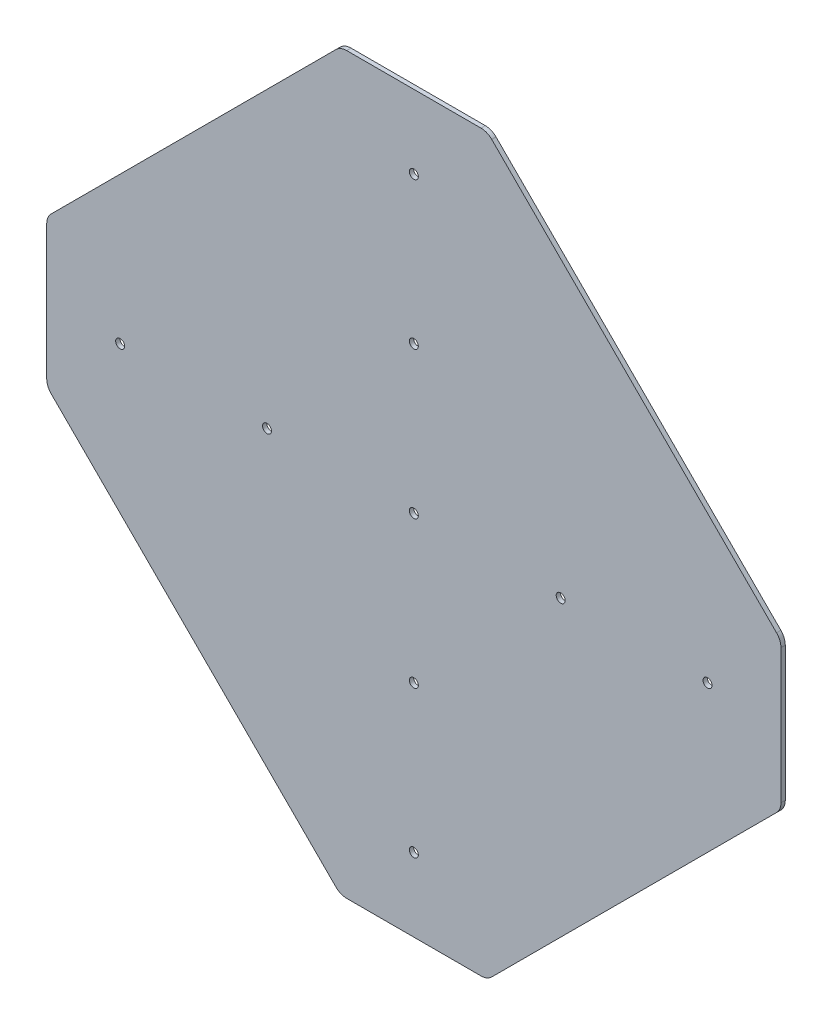
ISO-10303-21;
HEADER;
FILE_DESCRIPTION(('STEP AP214'),'2;1');
FILE_NAME('part.step','',(''),(''),'','','');
FILE_SCHEMA(('AUTOMOTIVE_DESIGN { 1 0 10303 214 1 1 1 1 }'));
ENDSEC;
DATA;
#1=APPLICATION_CONTEXT('core data for automotive mechanical design processes');
#2=APPLICATION_PROTOCOL_DEFINITION('international standard','automotive_design',2000,#1);
#3=PRODUCT_CONTEXT('',#1,'mechanical');
#4=PRODUCT('Part','Part','',(#3));
#5=PRODUCT_RELATED_PRODUCT_CATEGORY('part','',(#4));
#6=PRODUCT_DEFINITION_FORMATION('','',#4);
#7=PRODUCT_DEFINITION_CONTEXT('part definition',#1,'design');
#8=PRODUCT_DEFINITION('design','',#6,#7);
#9=PRODUCT_DEFINITION_SHAPE('','',#8);
#10=(LENGTH_UNIT() NAMED_UNIT(*) SI_UNIT(.MILLI.,.METRE.));
#11=(NAMED_UNIT(*) PLANE_ANGLE_UNIT() SI_UNIT($,.RADIAN.));
#12=(NAMED_UNIT(*) SI_UNIT($,.STERADIAN.) SOLID_ANGLE_UNIT());
#13=UNCERTAINTY_MEASURE_WITH_UNIT(LENGTH_MEASURE(1.E-05),#10,'distance_accuracy_value','');
#14=(GEOMETRIC_REPRESENTATION_CONTEXT(3) GLOBAL_UNCERTAINTY_ASSIGNED_CONTEXT((#13)) GLOBAL_UNIT_ASSIGNED_CONTEXT((#10,
#11,#12)) REPRESENTATION_CONTEXT('',''));
#15=CARTESIAN_POINT('',(0.,0.,0.));
#16=DIRECTION('',(0.,0.,1.));
#17=DIRECTION('',(1.,0.,0.));
#18=AXIS2_PLACEMENT_3D('',#15,#16,#17);
#19=CARTESIAN_POINT('',(129.381249997927,-24.6860258882,1.5875));
#20=DIRECTION('',(0.,0.,-1.));
#21=DIRECTION('',(-1.,0.,0.));
#22=AXIS2_PLACEMENT_3D('',#19,#20,#21);
#23=CYLINDRICAL_SURFACE('',#22,5.55625000207339);
#24=CARTESIAN_POINT('',(129.381249997927,-24.6860258882,0.));
#25=DIRECTION('',(0.,0.,-1.));
#26=DIRECTION('',(-1.,0.,0.));
#27=AXIS2_PLACEMENT_3D('',#24,#25,#26);
#28=CIRCLE('',#27,5.55625000207339);
#29=CARTESIAN_POINT('',(134.9375,-24.6860258882,0.));
#30=VERTEX_POINT('',#29);
#31=CARTESIAN_POINT('',(133.31011205236,-28.6148879426339,0.));
#32=VERTEX_POINT('',#31);
#33=EDGE_CURVE('E177',#30,#32,#28,.T.);
#34=ORIENTED_EDGE('',*,*,#33,.F.);
#35=DIRECTION('',(0.,0.,-1.));
#36=VECTOR('',#35,1.);
#37=CARTESIAN_POINT('',(134.9375,-24.6860258882,1.5875));
#38=LINE('',#37,#36);
#39=CARTESIAN_POINT('',(134.9375,-24.6860258882,1.5875));
#40=VERTEX_POINT('',#39);
#41=EDGE_CURVE('E11',#40,#30,#38,.T.);
#42=ORIENTED_EDGE('',*,*,#41,.F.);
#43=CARTESIAN_POINT('',(129.381249997927,-24.6860258882,1.5875));
#44=DIRECTION('',(0.,0.,-1.));
#45=DIRECTION('',(-1.,0.,0.));
#46=AXIS2_PLACEMENT_3D('',#43,#44,#45);
#47=CIRCLE('',#46,5.55625000207339);
#48=CARTESIAN_POINT('',(133.31011205236,-28.6148879426339,1.5875));
#49=VERTEX_POINT('',#48);
#50=EDGE_CURVE('E222',#40,#49,#47,.T.);
#51=ORIENTED_EDGE('',*,*,#50,.T.);
#52=DIRECTION('',(0.,0.,-1.));
#53=VECTOR('',#52,1.);
#54=CARTESIAN_POINT('',(133.31011205236,-28.6148879426339,1.5875));
#55=LINE('',#54,#53);
#56=EDGE_CURVE('E35',#49,#32,#55,.T.);
#57=ORIENTED_EDGE('',*,*,#56,.T.);
#58=EDGE_LOOP('',(#34,#42,#51,#57));
#59=FACE_BOUND('',#58,.T.);
#60=ADVANCED_FACE('F32',(#59),#23,.T.);
#61=CARTESIAN_POINT('',(134.9375,24.6860258882,1.5875));
#62=DIRECTION('',(1.,0.,0.));
#63=DIRECTION('',(0.,1.,0.));
#64=AXIS2_PLACEMENT_3D('',#61,#62,#63);
#65=PLANE('',#64);
#66=DIRECTION('',(0.,-1.,0.));
#67=VECTOR('',#66,1.);
#68=CARTESIAN_POINT('',(134.9375,24.6860258882,0.));
#69=LINE('',#68,#67);
#70=CARTESIAN_POINT('',(134.9375,24.6860258882,0.));
#71=VERTEX_POINT('',#70);
#72=EDGE_CURVE('E220',#71,#30,#69,.T.);
#73=ORIENTED_EDGE('',*,*,#72,.F.);
#74=DIRECTION('',(0.,0.,-1.));
#75=VECTOR('',#74,1.);
#76=CARTESIAN_POINT('',(134.9375,24.6860258882,1.5875));
#77=LINE('',#76,#75);
#78=CARTESIAN_POINT('',(134.9375,24.6860258882,1.5875));
#79=VERTEX_POINT('',#78);
#80=EDGE_CURVE('E41',#79,#71,#77,.T.);
#81=ORIENTED_EDGE('',*,*,#80,.F.);
#82=DIRECTION('',(0.,-1.,0.));
#83=VECTOR('',#82,1.);
#84=CARTESIAN_POINT('',(134.9375,24.6860258882,1.5875));
#85=LINE('',#84,#83);
#86=EDGE_CURVE('E167',#79,#40,#85,.T.);
#87=ORIENTED_EDGE('',*,*,#86,.T.);
#88=ORIENTED_EDGE('',*,*,#41,.T.);
#89=EDGE_LOOP('',(#73,#81,#87,#88));
#90=FACE_BOUND('',#89,.T.);
#91=ADVANCED_FACE('F250',(#90),#65,.T.);
#92=CARTESIAN_POINT('',(129.381249998963,24.6860258882,1.5875));
#93=DIRECTION('',(0.,0.,-1.));
#94=DIRECTION('',(-1.,0.,0.));
#95=AXIS2_PLACEMENT_3D('',#92,#93,#94);
#96=CYLINDRICAL_SURFACE('',#95,5.55625000103668);
#97=CARTESIAN_POINT('',(129.381249998963,24.6860258882,0.));
#98=DIRECTION('',(0.,0.,-1.));
#99=DIRECTION('',(-1.,0.,0.));
#100=AXIS2_PLACEMENT_3D('',#97,#98,#99);
#101=CIRCLE('',#100,5.55625000103668);
#102=CARTESIAN_POINT('',(133.310112052664,28.6148879419008,0.));
#103=VERTEX_POINT('',#102);
#104=EDGE_CURVE('E154',#103,#71,#101,.T.);
#105=ORIENTED_EDGE('',*,*,#104,.F.);
#106=DIRECTION('',(0.,0.,-1.));
#107=VECTOR('',#106,1.);
#108=CARTESIAN_POINT('',(133.310112052664,28.6148879419008,1.5875));
#109=LINE('',#108,#107);
#110=CARTESIAN_POINT('',(133.310112052664,28.6148879419008,1.5875));
#111=VERTEX_POINT('',#110);
#112=EDGE_CURVE('E149',#111,#103,#109,.T.);
#113=ORIENTED_EDGE('',*,*,#112,.F.);
#114=CARTESIAN_POINT('',(129.381249998963,24.6860258882,1.5875));
#115=DIRECTION('',(0.,0.,-1.));
#116=DIRECTION('',(-1.,0.,0.));
#117=AXIS2_PLACEMENT_3D('',#114,#115,#116);
#118=CIRCLE('',#117,5.55625000103668);
#119=EDGE_CURVE('E152',#111,#79,#118,.T.);
#120=ORIENTED_EDGE('',*,*,#119,.T.);
#121=ORIENTED_EDGE('',*,*,#80,.T.);
#122=EDGE_LOOP('',(#105,#113,#120,#121));
#123=FACE_BOUND('',#122,.T.);
#124=ADVANCED_FACE('F151',(#123),#96,.T.);
#125=CARTESIAN_POINT('',(28.6148879408641,133.310112053701,1.5875));
#126=DIRECTION('',(0.707106781186548,0.707106781186547,0.));
#127=DIRECTION('',(-0.707106781186547,0.707106781186548,0.));
#128=AXIS2_PLACEMENT_3D('',#125,#126,#127);
#129=PLANE('',#128);
#130=DIRECTION('',(0.707106781186547,-0.707106781186548,0.));
#131=VECTOR('',#130,1.);
#132=CARTESIAN_POINT('',(28.6148879408641,133.310112053701,0.));
#133=LINE('',#132,#131);
#134=CARTESIAN_POINT('',(28.6148879408641,133.310112053701,0.));
#135=VERTEX_POINT('',#134);
#136=EDGE_CURVE('E217',#135,#103,#133,.T.);
#137=ORIENTED_EDGE('',*,*,#136,.F.);
#138=DIRECTION('',(0.,0.,-1.));
#139=VECTOR('',#138,1.);
#140=CARTESIAN_POINT('',(28.6148879408641,133.310112053701,1.5875));
#141=LINE('',#140,#139);
#142=CARTESIAN_POINT('',(28.6148879408641,133.310112053701,1.5875));
#143=VERTEX_POINT('',#142);
#144=EDGE_CURVE('E159',#143,#135,#141,.T.);
#145=ORIENTED_EDGE('',*,*,#144,.F.);
#146=DIRECTION('',(0.707106781186547,-0.707106781186548,0.));
#147=VECTOR('',#146,1.);
#148=CARTESIAN_POINT('',(28.6148879408641,133.310112053701,1.5875));
#149=LINE('',#148,#147);
#150=EDGE_CURVE('E165',#143,#111,#149,.T.);
#151=ORIENTED_EDGE('',*,*,#150,.T.);
#152=ORIENTED_EDGE('',*,*,#112,.T.);
#153=EDGE_LOOP('',(#137,#145,#151,#152));
#154=FACE_BOUND('',#153,.T.);
#155=ADVANCED_FACE('F169',(#154),#129,.T.);
#156=CARTESIAN_POINT('',(24.6860258864302,129.381249999267,1.5875));
#157=DIRECTION('',(0.,0.,-1.));
#158=DIRECTION('',(-1.,0.,0.));
#159=AXIS2_PLACEMENT_3D('',#156,#157,#158);
#160=CYLINDRICAL_SURFACE('',#159,5.55625000207341);
#161=CARTESIAN_POINT('',(24.6860258864302,129.381249999267,0.));
#162=DIRECTION('',(0.,0.,-1.));
#163=DIRECTION('',(-1.,0.,0.));
#164=AXIS2_PLACEMENT_3D('',#161,#162,#163);
#165=CIRCLE('',#164,5.55625000207341);
#166=CARTESIAN_POINT('',(24.6860258864302,134.93750000134,0.));
#167=VERTEX_POINT('',#166);
#168=EDGE_CURVE('E214',#167,#135,#165,.T.);
#169=ORIENTED_EDGE('',*,*,#168,.F.);
#170=DIRECTION('',(0.,0.,-1.));
#171=VECTOR('',#170,1.);
#172=CARTESIAN_POINT('',(24.6860258864302,134.93750000134,1.5875));
#173=LINE('',#172,#171);
#174=CARTESIAN_POINT('',(24.6860258864302,134.93750000134,1.5875));
#175=VERTEX_POINT('',#174);
#176=EDGE_CURVE('E226',#175,#167,#173,.T.);
#177=ORIENTED_EDGE('',*,*,#176,.F.);
#178=CARTESIAN_POINT('',(24.6860258864302,129.381249999267,1.5875));
#179=DIRECTION('',(0.,0.,-1.));
#180=DIRECTION('',(-1.,0.,0.));
#181=AXIS2_PLACEMENT_3D('',#178,#179,#180);
#182=CIRCLE('',#181,5.55625000207341);
#183=EDGE_CURVE('E170',#175,#143,#182,.T.);
#184=ORIENTED_EDGE('',*,*,#183,.T.);
#185=ORIENTED_EDGE('',*,*,#144,.T.);
#186=EDGE_LOOP('',(#169,#177,#184,#185));
#187=FACE_BOUND('',#186,.T.);
#188=ADVANCED_FACE('F263',(#187),#160,.T.);
#189=CARTESIAN_POINT('',(-24.6860258899698,134.93750000134,1.5875));
#190=DIRECTION('',(0.,1.,0.));
#191=DIRECTION('',(0.,0.,1.));
#192=AXIS2_PLACEMENT_3D('',#189,#190,#191);
#193=PLANE('',#192);
#194=DIRECTION('',(1.,0.,0.));
#195=VECTOR('',#194,1.);
#196=CARTESIAN_POINT('',(-24.6860258899698,134.93750000134,0.));
#197=LINE('',#196,#195);
#198=CARTESIAN_POINT('',(-24.6860258899698,134.93750000134,0.));
#199=VERTEX_POINT('',#198);
#200=EDGE_CURVE('E211',#199,#167,#197,.T.);
#201=ORIENTED_EDGE('',*,*,#200,.F.);
#202=DIRECTION('',(0.,0.,-1.));
#203=VECTOR('',#202,1.);
#204=CARTESIAN_POINT('',(-24.6860258899698,134.93750000134,1.5875));
#205=LINE('',#204,#203);
#206=CARTESIAN_POINT('',(-24.6860258899698,134.93750000134,1.5875));
#207=VERTEX_POINT('',#206);
#208=EDGE_CURVE('E228',#207,#199,#205,.T.);
#209=ORIENTED_EDGE('',*,*,#208,.F.);
#210=DIRECTION('',(1.,0.,0.));
#211=VECTOR('',#210,1.);
#212=CARTESIAN_POINT('',(-24.6860258899698,134.93750000134,1.5875));
#213=LINE('',#212,#211);
#214=EDGE_CURVE('E172',#207,#175,#213,.T.);
#215=ORIENTED_EDGE('',*,*,#214,.T.);
#216=ORIENTED_EDGE('',*,*,#176,.T.);
#217=EDGE_LOOP('',(#201,#209,#215,#216));
#218=FACE_BOUND('',#217,.T.);
#219=ADVANCED_FACE('F266',(#218),#193,.T.);
#220=CARTESIAN_POINT('',(-24.6860258899698,129.381250000304,1.5875));
#221=DIRECTION('',(0.,0.,-1.));
#222=DIRECTION('',(-1.,0.,0.));
#223=AXIS2_PLACEMENT_3D('',#220,#221,#222);
#224=CYLINDRICAL_SURFACE('',#223,5.5562500010367);
#225=CARTESIAN_POINT('',(-24.6860258899698,129.381250000304,0.));
#226=DIRECTION('',(0.,0.,-1.));
#227=DIRECTION('',(-1.,0.,0.));
#228=AXIS2_PLACEMENT_3D('',#225,#226,#227);
#229=CIRCLE('',#228,5.5562500010367);
#230=CARTESIAN_POINT('',(-28.6148879436706,133.310112054004,0.));
#231=VERTEX_POINT('',#230);
#232=EDGE_CURVE('E208',#231,#199,#229,.T.);
#233=ORIENTED_EDGE('',*,*,#232,.F.);
#234=DIRECTION('',(0.,0.,-1.));
#235=VECTOR('',#234,1.);
#236=CARTESIAN_POINT('',(-28.6148879436706,133.310112054004,1.5875));
#237=LINE('',#236,#235);
#238=CARTESIAN_POINT('',(-28.6148879436706,133.310112054004,1.5875));
#239=VERTEX_POINT('',#238);
#240=EDGE_CURVE('E230',#239,#231,#237,.T.);
#241=ORIENTED_EDGE('',*,*,#240,.F.);
#242=CARTESIAN_POINT('',(-24.6860258899698,129.381250000304,1.5875));
#243=DIRECTION('',(0.,0.,-1.));
#244=DIRECTION('',(-1.,0.,0.));
#245=AXIS2_PLACEMENT_3D('',#242,#243,#244);
#246=CIRCLE('',#245,5.5562500010367);
#247=EDGE_CURVE('E438',#239,#207,#246,.T.);
#248=ORIENTED_EDGE('',*,*,#247,.T.);
#249=ORIENTED_EDGE('',*,*,#208,.T.);
#250=EDGE_LOOP('',(#233,#241,#248,#249));
#251=FACE_BOUND('',#250,.T.);
#252=ADVANCED_FACE('F270',(#251),#224,.T.);
#253=CARTESIAN_POINT('',(-133.310112055774,28.6148879419008,1.5875));
#254=DIRECTION('',(-0.707106781186547,0.707106781186548,0.));
#255=DIRECTION('',(-0.707106781186548,-0.707106781186547,0.));
#256=AXIS2_PLACEMENT_3D('',#253,#254,#255);
#257=PLANE('',#256);
#258=DIRECTION('',(0.707106781186548,0.707106781186547,0.));
#259=VECTOR('',#258,1.);
#260=CARTESIAN_POINT('',(-133.310112055774,28.6148879419008,0.));
#261=LINE('',#260,#259);
#262=CARTESIAN_POINT('',(-133.310112055774,28.6148879419008,0.));
#263=VERTEX_POINT('',#262);
#264=EDGE_CURVE('E205',#263,#231,#261,.T.);
#265=ORIENTED_EDGE('',*,*,#264,.F.);
#266=DIRECTION('',(0.,0.,-1.));
#267=VECTOR('',#266,1.);
#268=CARTESIAN_POINT('',(-133.310112055774,28.6148879419008,1.5875));
#269=LINE('',#268,#267);
#270=CARTESIAN_POINT('',(-133.310112055774,28.6148879419008,1.5875));
#271=VERTEX_POINT('',#270);
#272=EDGE_CURVE('E232',#271,#263,#269,.T.);
#273=ORIENTED_EDGE('',*,*,#272,.F.);
#274=DIRECTION('',(0.707106781186548,0.707106781186547,0.));
#275=VECTOR('',#274,1.);
#276=CARTESIAN_POINT('',(-133.310112055774,28.6148879419008,1.5875));
#277=LINE('',#276,#275);
#278=EDGE_CURVE('E435',#271,#239,#277,.T.);
#279=ORIENTED_EDGE('',*,*,#278,.T.);
#280=ORIENTED_EDGE('',*,*,#240,.T.);
#281=EDGE_LOOP('',(#265,#273,#279,#280));
#282=FACE_BOUND('',#281,.T.);
#283=ADVANCED_FACE('F274',(#282),#257,.T.);
#284=CARTESIAN_POINT('',(-129.38125000134,24.686025887467,1.5875));
#285=DIRECTION('',(0.,0.,-1.));
#286=DIRECTION('',(-1.,0.,0.));
#287=AXIS2_PLACEMENT_3D('',#284,#285,#286);
#288=CYLINDRICAL_SURFACE('',#287,5.55625000207338);
#289=CARTESIAN_POINT('',(-129.38125000134,24.686025887467,0.));
#290=DIRECTION('',(0.,0.,-1.));
#291=DIRECTION('',(-1.,0.,0.));
#292=AXIS2_PLACEMENT_3D('',#289,#290,#291);
#293=CIRCLE('',#292,5.55625000207338);
#294=CARTESIAN_POINT('',(-134.937500003414,24.686025887467,0.));
#295=VERTEX_POINT('',#294);
#296=EDGE_CURVE('E202',#295,#263,#293,.T.);
#297=ORIENTED_EDGE('',*,*,#296,.F.);
#298=DIRECTION('',(0.,0.,-1.));
#299=VECTOR('',#298,1.);
#300=CARTESIAN_POINT('',(-134.937500003414,24.686025887467,1.5875));
#301=LINE('',#300,#299);
#302=CARTESIAN_POINT('',(-134.937500003414,24.686025887467,1.5875));
#303=VERTEX_POINT('',#302);
#304=EDGE_CURVE('E234',#303,#295,#301,.T.);
#305=ORIENTED_EDGE('',*,*,#304,.F.);
#306=CARTESIAN_POINT('',(-129.38125000134,24.686025887467,1.5875));
#307=DIRECTION('',(0.,0.,-1.));
#308=DIRECTION('',(-1.,0.,0.));
#309=AXIS2_PLACEMENT_3D('',#306,#307,#308);
#310=CIRCLE('',#309,5.55625000207338);
#311=EDGE_CURVE('E432',#303,#271,#310,.T.);
#312=ORIENTED_EDGE('',*,*,#311,.T.);
#313=ORIENTED_EDGE('',*,*,#272,.T.);
#314=EDGE_LOOP('',(#297,#305,#312,#313));
#315=FACE_BOUND('',#314,.T.);
#316=ADVANCED_FACE('F278',(#315),#288,.T.);
#317=CARTESIAN_POINT('',(-134.937500003414,-24.6860258878964,1.5875));
#318=DIRECTION('',(-1.,0.,0.));
#319=DIRECTION('',(0.,0.,1.));
#320=AXIS2_PLACEMENT_3D('',#317,#318,#319);
#321=PLANE('',#320);
#322=DIRECTION('',(0.,1.,0.));
#323=VECTOR('',#322,1.);
#324=CARTESIAN_POINT('',(-134.937500003414,-24.6860258878964,0.));
#325=LINE('',#324,#323);
#326=CARTESIAN_POINT('',(-134.937500003414,-24.6860258878964,0.));
#327=VERTEX_POINT('',#326);
#328=EDGE_CURVE('E199',#327,#295,#325,.T.);
#329=ORIENTED_EDGE('',*,*,#328,.F.);
#330=DIRECTION('',(0.,0.,-1.));
#331=VECTOR('',#330,1.);
#332=CARTESIAN_POINT('',(-134.937500003414,-24.6860258878964,1.5875));
#333=LINE('',#332,#331);
#334=CARTESIAN_POINT('',(-134.937500003414,-24.6860258878964,1.5875));
#335=VERTEX_POINT('',#334);
#336=EDGE_CURVE('E236',#335,#327,#333,.T.);
#337=ORIENTED_EDGE('',*,*,#336,.F.);
#338=DIRECTION('',(0.,1.,0.));
#339=VECTOR('',#338,1.);
#340=CARTESIAN_POINT('',(-134.937500003414,-24.6860258878964,1.5875));
#341=LINE('',#340,#339);
#342=EDGE_CURVE('E429',#335,#303,#341,.T.);
#343=ORIENTED_EDGE('',*,*,#342,.T.);
#344=ORIENTED_EDGE('',*,*,#304,.T.);
#345=EDGE_LOOP('',(#329,#337,#343,#344));
#346=FACE_BOUND('',#345,.T.);
#347=ADVANCED_FACE('F282',(#346),#321,.T.);
#348=CARTESIAN_POINT('',(-129.38125000134,-24.6860258878964,1.5875));
#349=DIRECTION('',(0.,0.,-1.));
#350=DIRECTION('',(-1.,0.,0.));
#351=AXIS2_PLACEMENT_3D('',#348,#349,#350);
#352=CYLINDRICAL_SURFACE('',#351,5.5562500020734);
#353=CARTESIAN_POINT('',(-129.38125000134,-24.6860258878964,0.));
#354=DIRECTION('',(0.,0.,-1.));
#355=DIRECTION('',(-1.,0.,0.));
#356=AXIS2_PLACEMENT_3D('',#353,#354,#355);
#357=CIRCLE('',#356,5.5562500020734);
#358=CARTESIAN_POINT('',(-133.310112055774,-28.6148879423302,0.));
#359=VERTEX_POINT('',#358);
#360=EDGE_CURVE('E196',#359,#327,#357,.T.);
#361=ORIENTED_EDGE('',*,*,#360,.F.);
#362=DIRECTION('',(0.,0.,-1.));
#363=VECTOR('',#362,1.);
#364=CARTESIAN_POINT('',(-133.310112055774,-28.6148879423302,1.5875));
#365=LINE('',#364,#363);
#366=CARTESIAN_POINT('',(-133.310112055774,-28.6148879423302,1.5875));
#367=VERTEX_POINT('',#366);
#368=EDGE_CURVE('E238',#367,#359,#365,.T.);
#369=ORIENTED_EDGE('',*,*,#368,.F.);
#370=CARTESIAN_POINT('',(-129.38125000134,-24.6860258878964,1.5875));
#371=DIRECTION('',(0.,0.,-1.));
#372=DIRECTION('',(-1.,0.,0.));
#373=AXIS2_PLACEMENT_3D('',#370,#371,#372);
#374=CIRCLE('',#373,5.5562500020734);
#375=EDGE_CURVE('E426',#367,#335,#374,.T.);
#376=ORIENTED_EDGE('',*,*,#375,.T.);
#377=ORIENTED_EDGE('',*,*,#336,.T.);
#378=EDGE_LOOP('',(#361,#369,#376,#377));
#379=FACE_BOUND('',#378,.T.);
#380=ADVANCED_FACE('F286',(#379),#352,.T.);
#381=CARTESIAN_POINT('',(-28.6148879439742,-133.31011205413,1.5875));
#382=DIRECTION('',(-0.707106781186548,-0.707106781186548,0.));
#383=DIRECTION('',(0.707106781186548,-0.707106781186548,0.));
#384=AXIS2_PLACEMENT_3D('',#381,#382,#383);
#385=PLANE('',#384);
#386=DIRECTION('',(-0.707106781186548,0.707106781186548,0.));
#387=VECTOR('',#386,1.);
#388=CARTESIAN_POINT('',(-28.6148879439742,-133.31011205413,0.));
#389=LINE('',#388,#387);
#390=CARTESIAN_POINT('',(-28.6148879439742,-133.31011205413,0.));
#391=VERTEX_POINT('',#390);
#392=EDGE_CURVE('E193',#391,#359,#389,.T.);
#393=ORIENTED_EDGE('',*,*,#392,.F.);
#394=DIRECTION('',(0.,0.,-1.));
#395=VECTOR('',#394,1.);
#396=CARTESIAN_POINT('',(-28.6148879439742,-133.31011205413,1.5875));
#397=LINE('',#396,#395);
#398=CARTESIAN_POINT('',(-28.6148879439742,-133.31011205413,1.5875));
#399=VERTEX_POINT('',#398);
#400=EDGE_CURVE('E240',#399,#391,#397,.T.);
#401=ORIENTED_EDGE('',*,*,#400,.F.);
#402=DIRECTION('',(-0.707106781186548,0.707106781186548,0.));
#403=VECTOR('',#402,1.);
#404=CARTESIAN_POINT('',(-28.6148879439742,-133.31011205413,1.5875));
#405=LINE('',#404,#403);
#406=EDGE_CURVE('E423',#399,#367,#405,.T.);
#407=ORIENTED_EDGE('',*,*,#406,.T.);
#408=ORIENTED_EDGE('',*,*,#368,.T.);
#409=EDGE_LOOP('',(#393,#401,#407,#408));
#410=FACE_BOUND('',#409,.T.);
#411=ADVANCED_FACE('F290',(#410),#385,.T.);
#412=CARTESIAN_POINT('',(-24.6860258895403,-129.381249999696,1.5875));
#413=DIRECTION('',(0.,0.,-1.));
#414=DIRECTION('',(-1.,0.,0.));
#415=AXIS2_PLACEMENT_3D('',#412,#413,#414);
#416=CYLINDRICAL_SURFACE('',#415,5.55625000207341);
#417=CARTESIAN_POINT('',(-24.6860258895403,-129.381249999696,0.));
#418=DIRECTION('',(0.,0.,-1.));
#419=DIRECTION('',(-1.,0.,0.));
#420=AXIS2_PLACEMENT_3D('',#417,#418,#419);
#421=CIRCLE('',#420,5.55625000207341);
#422=CARTESIAN_POINT('',(-24.6860258895403,-134.93750000177,0.));
#423=VERTEX_POINT('',#422);
#424=EDGE_CURVE('E190',#423,#391,#421,.T.);
#425=ORIENTED_EDGE('',*,*,#424,.F.);
#426=DIRECTION('',(0.,0.,-1.));
#427=VECTOR('',#426,1.);
#428=CARTESIAN_POINT('',(-24.6860258895403,-134.93750000177,1.5875));
#429=LINE('',#428,#427);
#430=CARTESIAN_POINT('',(-24.6860258895403,-134.93750000177,1.5875));
#431=VERTEX_POINT('',#430);
#432=EDGE_CURVE('E242',#431,#423,#429,.T.);
#433=ORIENTED_EDGE('',*,*,#432,.F.);
#434=CARTESIAN_POINT('',(-24.6860258895403,-129.381249999696,1.5875));
#435=DIRECTION('',(0.,0.,-1.));
#436=DIRECTION('',(-1.,0.,0.));
#437=AXIS2_PLACEMENT_3D('',#434,#435,#436);
#438=CIRCLE('',#437,5.55625000207341);
#439=EDGE_CURVE('E420',#431,#399,#438,.T.);
#440=ORIENTED_EDGE('',*,*,#439,.T.);
#441=ORIENTED_EDGE('',*,*,#400,.T.);
#442=EDGE_LOOP('',(#425,#433,#440,#441));
#443=FACE_BOUND('',#442,.T.);
#444=ADVANCED_FACE('F294',(#443),#416,.T.);
#445=CARTESIAN_POINT('',(24.6860258868597,-134.93750000177,1.5875));
#446=DIRECTION('',(0.,-1.,0.));
#447=DIRECTION('',(0.,0.,-1.));
#448=AXIS2_PLACEMENT_3D('',#445,#446,#447);
#449=PLANE('',#448);
#450=DIRECTION('',(-1.,0.,0.));
#451=VECTOR('',#450,1.);
#452=CARTESIAN_POINT('',(24.6860258868597,-134.93750000177,0.));
#453=LINE('',#452,#451);
#454=CARTESIAN_POINT('',(24.6860258868597,-134.93750000177,0.));
#455=VERTEX_POINT('',#454);
#456=EDGE_CURVE('E187',#455,#423,#453,.T.);
#457=ORIENTED_EDGE('',*,*,#456,.F.);
#458=DIRECTION('',(0.,0.,-1.));
#459=VECTOR('',#458,1.);
#460=CARTESIAN_POINT('',(24.6860258868597,-134.93750000177,1.5875));
#461=LINE('',#460,#459);
#462=CARTESIAN_POINT('',(24.6860258868597,-134.93750000177,1.5875));
#463=VERTEX_POINT('',#462);
#464=EDGE_CURVE('E244',#463,#455,#461,.T.);
#465=ORIENTED_EDGE('',*,*,#464,.F.);
#466=DIRECTION('',(-1.,0.,0.));
#467=VECTOR('',#466,1.);
#468=CARTESIAN_POINT('',(24.6860258868597,-134.93750000177,1.5875));
#469=LINE('',#468,#467);
#470=EDGE_CURVE('E417',#463,#431,#469,.T.);
#471=ORIENTED_EDGE('',*,*,#470,.T.);
#472=ORIENTED_EDGE('',*,*,#432,.T.);
#473=EDGE_LOOP('',(#457,#465,#471,#472));
#474=FACE_BOUND('',#473,.T.);
#475=ADVANCED_FACE('F298',(#474),#449,.T.);
#476=CARTESIAN_POINT('',(24.6860258868597,-129.381250000733,1.5875));
#477=DIRECTION('',(0.,0.,-1.));
#478=DIRECTION('',(-1.,0.,0.));
#479=AXIS2_PLACEMENT_3D('',#476,#477,#478);
#480=CYLINDRICAL_SURFACE('',#479,5.55625000103668);
#481=CARTESIAN_POINT('',(24.6860258868597,-129.381250000733,0.));
#482=DIRECTION('',(0.,0.,-1.));
#483=DIRECTION('',(-1.,0.,0.));
#484=AXIS2_PLACEMENT_3D('',#481,#482,#483);
#485=CIRCLE('',#484,5.55625000103668);
#486=CARTESIAN_POINT('',(28.6148879405604,-133.310112054434,0.));
#487=VERTEX_POINT('',#486);
#488=EDGE_CURVE('E184',#487,#455,#485,.T.);
#489=ORIENTED_EDGE('',*,*,#488,.F.);
#490=DIRECTION('',(0.,0.,-1.));
#491=VECTOR('',#490,1.);
#492=CARTESIAN_POINT('',(28.6148879405604,-133.310112054434,1.5875));
#493=LINE('',#492,#491);
#494=CARTESIAN_POINT('',(28.6148879405604,-133.310112054434,1.5875));
#495=VERTEX_POINT('',#494);
#496=EDGE_CURVE('E245',#495,#487,#493,.T.);
#497=ORIENTED_EDGE('',*,*,#496,.F.);
#498=CARTESIAN_POINT('',(24.6860258868597,-129.381250000733,1.5875));
#499=DIRECTION('',(0.,0.,-1.));
#500=DIRECTION('',(-1.,0.,0.));
#501=AXIS2_PLACEMENT_3D('',#498,#499,#500);
#502=CIRCLE('',#501,5.55625000103668);
#503=EDGE_CURVE('E414',#495,#463,#502,.T.);
#504=ORIENTED_EDGE('',*,*,#503,.T.);
#505=ORIENTED_EDGE('',*,*,#464,.T.);
#506=EDGE_LOOP('',(#489,#497,#504,#505));
#507=FACE_BOUND('',#506,.T.);
#508=ADVANCED_FACE('F302',(#507),#480,.T.);
#509=CARTESIAN_POINT('',(133.31011205236,-28.6148879426339,1.5875));
#510=DIRECTION('',(0.707106781186548,-0.707106781186548,0.));
#511=DIRECTION('',(0.707106781186548,0.707106781186548,0.));
#512=AXIS2_PLACEMENT_3D('',#509,#510,#511);
#513=PLANE('',#512);
#514=DIRECTION('',(-0.707106781186547,-0.707106781186547,0.));
#515=VECTOR('',#514,1.);
#516=CARTESIAN_POINT('',(133.31011205236,-28.6148879426339,0.));
#517=LINE('',#516,#515);
#518=EDGE_CURVE('E180',#32,#487,#517,.T.);
#519=ORIENTED_EDGE('',*,*,#518,.F.);
#520=ORIENTED_EDGE('',*,*,#56,.F.);
#521=DIRECTION('',(-0.707106781186547,-0.707106781186547,0.));
#522=VECTOR('',#521,1.);
#523=CARTESIAN_POINT('',(133.31011205236,-28.6148879426339,1.5875));
#524=LINE('',#523,#522);
#525=EDGE_CURVE('E412',#49,#495,#524,.T.);
#526=ORIENTED_EDGE('',*,*,#525,.T.);
#527=ORIENTED_EDGE('',*,*,#496,.T.);
#528=EDGE_LOOP('',(#519,#520,#526,#527));
#529=FACE_BOUND('',#528,.T.);
#530=ADVANCED_FACE('F247',(#529),#513,.T.);
#531=CARTESIAN_POINT('',(129.381249997927,-24.6860258882,1.5875));
#532=DIRECTION('',(0.,0.,-1.));
#533=DIRECTION('',(-1.,0.,0.));
#534=AXIS2_PLACEMENT_3D('',#531,#532,#533);
#535=PLANE('',#534);
#536=CARTESIAN_POINT('',(-107.95,0.,1.5875));
#537=DIRECTION('',(0.,0.,-1.));
#538=DIRECTION('',(1.,0.,0.));
#539=AXIS2_PLACEMENT_3D('',#536,#537,#538);
#540=CIRCLE('',#539,1.651);
#541=CARTESIAN_POINT('',(-106.299,0.,1.5875));
#542=VERTEX_POINT('',#541);
#543=EDGE_CURVE('E357',#542,#542,#540,.T.);
#544=ORIENTED_EDGE('',*,*,#543,.T.);
#545=EDGE_LOOP('',(#544));
#546=FACE_BOUND('',#545,.T.);
#547=CARTESIAN_POINT('',(107.95,0.,1.5875));
#548=DIRECTION('',(0.,0.,-1.));
#549=DIRECTION('',(1.,0.,0.));
#550=AXIS2_PLACEMENT_3D('',#547,#548,#549);
#551=CIRCLE('',#550,1.651);
#552=CARTESIAN_POINT('',(109.601,0.,1.5875));
#553=VERTEX_POINT('',#552);
#554=EDGE_CURVE('E365',#553,#553,#551,.T.);
#555=ORIENTED_EDGE('',*,*,#554,.T.);
#556=EDGE_LOOP('',(#555));
#557=FACE_BOUND('',#556,.T.);
#558=CARTESIAN_POINT('',(0.,-53.975,1.5875));
#559=DIRECTION('',(0.,0.,-1.));
#560=DIRECTION('',(1.,0.,0.));
#561=AXIS2_PLACEMENT_3D('',#558,#559,#560);
#562=CIRCLE('',#561,1.651);
#563=CARTESIAN_POINT('',(1.651,-53.975,1.5875));
#564=VERTEX_POINT('',#563);
#565=EDGE_CURVE('E371',#564,#564,#562,.T.);
#566=ORIENTED_EDGE('',*,*,#565,.T.);
#567=EDGE_LOOP('',(#566));
#568=FACE_BOUND('',#567,.T.);
#569=CARTESIAN_POINT('',(-53.975,0.,1.5875));
#570=DIRECTION('',(0.,0.,-1.));
#571=DIRECTION('',(1.,0.,0.));
#572=AXIS2_PLACEMENT_3D('',#569,#570,#571);
#573=CIRCLE('',#572,1.65099999999999);
#574=CARTESIAN_POINT('',(-52.324,0.,1.5875));
#575=VERTEX_POINT('',#574);
#576=EDGE_CURVE('E377',#575,#575,#573,.T.);
#577=ORIENTED_EDGE('',*,*,#576,.T.);
#578=EDGE_LOOP('',(#577));
#579=FACE_BOUND('',#578,.T.);
#580=CARTESIAN_POINT('',(53.975,0.,1.5875));
#581=DIRECTION('',(0.,0.,-1.));
#582=DIRECTION('',(1.,0.,0.));
#583=AXIS2_PLACEMENT_3D('',#580,#581,#582);
#584=CIRCLE('',#583,1.651);
#585=CARTESIAN_POINT('',(55.626,0.,1.5875));
#586=VERTEX_POINT('',#585);
#587=EDGE_CURVE('E383',#586,#586,#584,.T.);
#588=ORIENTED_EDGE('',*,*,#587,.T.);
#589=EDGE_LOOP('',(#588));
#590=FACE_BOUND('',#589,.T.);
#591=CARTESIAN_POINT('',(0.,107.95,1.5875));
#592=DIRECTION('',(0.,0.,-1.));
#593=DIRECTION('',(1.,0.,0.));
#594=AXIS2_PLACEMENT_3D('',#591,#592,#593);
#595=CIRCLE('',#594,1.651);
#596=CARTESIAN_POINT('',(1.651,107.95,1.5875));
#597=VERTEX_POINT('',#596);
#598=EDGE_CURVE('E389',#597,#597,#595,.T.);
#599=ORIENTED_EDGE('',*,*,#598,.T.);
#600=EDGE_LOOP('',(#599));
#601=FACE_BOUND('',#600,.T.);
#602=CARTESIAN_POINT('',(0.,-107.95,1.5875));
#603=DIRECTION('',(0.,0.,-1.));
#604=DIRECTION('',(1.,0.,0.));
#605=AXIS2_PLACEMENT_3D('',#602,#603,#604);
#606=CIRCLE('',#605,1.651);
#607=CARTESIAN_POINT('',(1.651,-107.95,1.5875));
#608=VERTEX_POINT('',#607);
#609=EDGE_CURVE('E395',#608,#608,#606,.T.);
#610=ORIENTED_EDGE('',*,*,#609,.T.);
#611=EDGE_LOOP('',(#610));
#612=FACE_BOUND('',#611,.T.);
#613=CARTESIAN_POINT('',(0.,0.,1.5875));
#614=DIRECTION('',(0.,0.,-1.));
#615=DIRECTION('',(1.,0.,0.));
#616=AXIS2_PLACEMENT_3D('',#613,#614,#615);
#617=CIRCLE('',#616,1.651);
#618=CARTESIAN_POINT('',(1.651,0.,1.5875));
#619=VERTEX_POINT('',#618);
#620=EDGE_CURVE('E401',#619,#619,#617,.T.);
#621=ORIENTED_EDGE('',*,*,#620,.T.);
#622=EDGE_LOOP('',(#621));
#623=FACE_BOUND('',#622,.T.);
#624=CARTESIAN_POINT('',(0.,53.975,1.5875));
#625=DIRECTION('',(0.,0.,-1.));
#626=DIRECTION('',(1.,0.,0.));
#627=AXIS2_PLACEMENT_3D('',#624,#625,#626);
#628=CIRCLE('',#627,1.651);
#629=CARTESIAN_POINT('',(1.651,53.975,1.5875));
#630=VERTEX_POINT('',#629);
#631=EDGE_CURVE('E181',#630,#630,#628,.T.);
#632=ORIENTED_EDGE('',*,*,#631,.T.);
#633=EDGE_LOOP('',(#632));
#634=FACE_BOUND('',#633,.T.);
#635=ORIENTED_EDGE('',*,*,#50,.F.);
#636=ORIENTED_EDGE('',*,*,#86,.F.);
#637=ORIENTED_EDGE('',*,*,#119,.F.);
#638=ORIENTED_EDGE('',*,*,#150,.F.);
#639=ORIENTED_EDGE('',*,*,#183,.F.);
#640=ORIENTED_EDGE('',*,*,#214,.F.);
#641=ORIENTED_EDGE('',*,*,#247,.F.);
#642=ORIENTED_EDGE('',*,*,#278,.F.);
#643=ORIENTED_EDGE('',*,*,#311,.F.);
#644=ORIENTED_EDGE('',*,*,#342,.F.);
#645=ORIENTED_EDGE('',*,*,#375,.F.);
#646=ORIENTED_EDGE('',*,*,#406,.F.);
#647=ORIENTED_EDGE('',*,*,#439,.F.);
#648=ORIENTED_EDGE('',*,*,#470,.F.);
#649=ORIENTED_EDGE('',*,*,#503,.F.);
#650=ORIENTED_EDGE('',*,*,#525,.F.);
#651=EDGE_LOOP('',(#635,#636,#637,#638,#639,#640,#641,#642,#643,#644,#645,#646,#647,#648,#649,#650));
#652=FACE_BOUND('',#651,.T.);
#653=ADVANCED_FACE('F163',(#546,#557,#568,#579,#590,#601,#612,#623,#634,#652),#535,.F.);
#654=CARTESIAN_POINT('',(129.381249997927,-24.6860258882,0.));
#655=DIRECTION('',(0.,0.,-1.));
#656=DIRECTION('',(-1.,0.,0.));
#657=AXIS2_PLACEMENT_3D('',#654,#655,#656);
#658=PLANE('',#657);
#659=CARTESIAN_POINT('',(-107.95,0.,0.));
#660=DIRECTION('',(0.,0.,-1.));
#661=DIRECTION('',(1.,0.,0.));
#662=AXIS2_PLACEMENT_3D('',#659,#660,#661);
#663=CIRCLE('',#662,1.651);
#664=CARTESIAN_POINT('',(-106.299,0.,0.));
#665=VERTEX_POINT('',#664);
#666=EDGE_CURVE('E360',#665,#665,#663,.T.);
#667=ORIENTED_EDGE('',*,*,#666,.F.);
#668=EDGE_LOOP('',(#667));
#669=FACE_BOUND('',#668,.T.);
#670=CARTESIAN_POINT('',(107.95,0.,0.));
#671=DIRECTION('',(0.,0.,-1.));
#672=DIRECTION('',(1.,0.,0.));
#673=AXIS2_PLACEMENT_3D('',#670,#671,#672);
#674=CIRCLE('',#673,1.651);
#675=CARTESIAN_POINT('',(109.601,0.,0.));
#676=VERTEX_POINT('',#675);
#677=EDGE_CURVE('E362',#676,#676,#674,.T.);
#678=ORIENTED_EDGE('',*,*,#677,.F.);
#679=EDGE_LOOP('',(#678));
#680=FACE_BOUND('',#679,.T.);
#681=CARTESIAN_POINT('',(0.,-53.975,0.));
#682=DIRECTION('',(0.,0.,-1.));
#683=DIRECTION('',(1.,0.,0.));
#684=AXIS2_PLACEMENT_3D('',#681,#682,#683);
#685=CIRCLE('',#684,1.651);
#686=CARTESIAN_POINT('',(1.651,-53.975,0.));
#687=VERTEX_POINT('',#686);
#688=EDGE_CURVE('E368',#687,#687,#685,.T.);
#689=ORIENTED_EDGE('',*,*,#688,.F.);
#690=EDGE_LOOP('',(#689));
#691=FACE_BOUND('',#690,.T.);
#692=CARTESIAN_POINT('',(-53.975,0.,0.));
#693=DIRECTION('',(0.,0.,-1.));
#694=DIRECTION('',(1.,0.,0.));
#695=AXIS2_PLACEMENT_3D('',#692,#693,#694);
#696=CIRCLE('',#695,1.65099999999999);
#697=CARTESIAN_POINT('',(-52.324,0.,0.));
#698=VERTEX_POINT('',#697);
#699=EDGE_CURVE('E374',#698,#698,#696,.T.);
#700=ORIENTED_EDGE('',*,*,#699,.F.);
#701=EDGE_LOOP('',(#700));
#702=FACE_BOUND('',#701,.T.);
#703=CARTESIAN_POINT('',(53.975,0.,0.));
#704=DIRECTION('',(0.,0.,-1.));
#705=DIRECTION('',(1.,0.,0.));
#706=AXIS2_PLACEMENT_3D('',#703,#704,#705);
#707=CIRCLE('',#706,1.651);
#708=CARTESIAN_POINT('',(55.626,0.,0.));
#709=VERTEX_POINT('',#708);
#710=EDGE_CURVE('E380',#709,#709,#707,.T.);
#711=ORIENTED_EDGE('',*,*,#710,.F.);
#712=EDGE_LOOP('',(#711));
#713=FACE_BOUND('',#712,.T.);
#714=CARTESIAN_POINT('',(0.,107.95,0.));
#715=DIRECTION('',(0.,0.,-1.));
#716=DIRECTION('',(1.,0.,0.));
#717=AXIS2_PLACEMENT_3D('',#714,#715,#716);
#718=CIRCLE('',#717,1.651);
#719=CARTESIAN_POINT('',(1.651,107.95,0.));
#720=VERTEX_POINT('',#719);
#721=EDGE_CURVE('E386',#720,#720,#718,.T.);
#722=ORIENTED_EDGE('',*,*,#721,.F.);
#723=EDGE_LOOP('',(#722));
#724=FACE_BOUND('',#723,.T.);
#725=CARTESIAN_POINT('',(0.,-107.95,0.));
#726=DIRECTION('',(0.,0.,-1.));
#727=DIRECTION('',(1.,0.,0.));
#728=AXIS2_PLACEMENT_3D('',#725,#726,#727);
#729=CIRCLE('',#728,1.651);
#730=CARTESIAN_POINT('',(1.651,-107.95,0.));
#731=VERTEX_POINT('',#730);
#732=EDGE_CURVE('E392',#731,#731,#729,.T.);
#733=ORIENTED_EDGE('',*,*,#732,.F.);
#734=EDGE_LOOP('',(#733));
#735=FACE_BOUND('',#734,.T.);
#736=CARTESIAN_POINT('',(0.,0.,0.));
#737=DIRECTION('',(0.,0.,-1.));
#738=DIRECTION('',(1.,0.,0.));
#739=AXIS2_PLACEMENT_3D('',#736,#737,#738);
#740=CIRCLE('',#739,1.651);
#741=CARTESIAN_POINT('',(1.651,0.,0.));
#742=VERTEX_POINT('',#741);
#743=EDGE_CURVE('E398',#742,#742,#740,.T.);
#744=ORIENTED_EDGE('',*,*,#743,.F.);
#745=EDGE_LOOP('',(#744));
#746=FACE_BOUND('',#745,.T.);
#747=CARTESIAN_POINT('',(0.,53.975,0.));
#748=DIRECTION('',(0.,0.,-1.));
#749=DIRECTION('',(1.,0.,0.));
#750=AXIS2_PLACEMENT_3D('',#747,#748,#749);
#751=CIRCLE('',#750,1.651);
#752=CARTESIAN_POINT('',(1.651,53.975,0.));
#753=VERTEX_POINT('',#752);
#754=EDGE_CURVE('E404',#753,#753,#751,.T.);
#755=ORIENTED_EDGE('',*,*,#754,.F.);
#756=EDGE_LOOP('',(#755));
#757=FACE_BOUND('',#756,.T.);
#758=ORIENTED_EDGE('',*,*,#33,.T.);
#759=ORIENTED_EDGE('',*,*,#518,.T.);
#760=ORIENTED_EDGE('',*,*,#488,.T.);
#761=ORIENTED_EDGE('',*,*,#456,.T.);
#762=ORIENTED_EDGE('',*,*,#424,.T.);
#763=ORIENTED_EDGE('',*,*,#392,.T.);
#764=ORIENTED_EDGE('',*,*,#360,.T.);
#765=ORIENTED_EDGE('',*,*,#328,.T.);
#766=ORIENTED_EDGE('',*,*,#296,.T.);
#767=ORIENTED_EDGE('',*,*,#264,.T.);
#768=ORIENTED_EDGE('',*,*,#232,.T.);
#769=ORIENTED_EDGE('',*,*,#200,.T.);
#770=ORIENTED_EDGE('',*,*,#168,.T.);
#771=ORIENTED_EDGE('',*,*,#136,.T.);
#772=ORIENTED_EDGE('',*,*,#104,.T.);
#773=ORIENTED_EDGE('',*,*,#72,.T.);
#774=EDGE_LOOP('',(#758,#759,#760,#761,#762,#763,#764,#765,#766,#767,#768,#769,#770,#771,#772,#773));
#775=FACE_BOUND('',#774,.T.);
#776=ADVANCED_FACE('F249',(#669,#680,#691,#702,#713,#724,#735,#746,#757,#775),#658,.T.);
#777=CARTESIAN_POINT('',(0.,53.975,1.5875));
#778=DIRECTION('',(0.,0.,-1.));
#779=DIRECTION('',(-1.,0.,0.));
#780=AXIS2_PLACEMENT_3D('',#777,#778,#779);
#781=CYLINDRICAL_SURFACE('',#780,1.651);
#782=ORIENTED_EDGE('',*,*,#631,.F.);
#783=EDGE_LOOP('',(#782));
#784=FACE_BOUND('',#783,.T.);
#785=ORIENTED_EDGE('',*,*,#754,.T.);
#786=EDGE_LOOP('',(#785));
#787=FACE_BOUND('',#786,.T.);
#788=ADVANCED_FACE('F314',(#784,#787),#781,.F.);
#789=CARTESIAN_POINT('',(0.,0.,1.5875));
#790=DIRECTION('',(0.,0.,-1.));
#791=DIRECTION('',(-1.,0.,0.));
#792=AXIS2_PLACEMENT_3D('',#789,#790,#791);
#793=CYLINDRICAL_SURFACE('',#792,1.651);
#794=ORIENTED_EDGE('',*,*,#620,.F.);
#795=EDGE_LOOP('',(#794));
#796=FACE_BOUND('',#795,.T.);
#797=ORIENTED_EDGE('',*,*,#743,.T.);
#798=EDGE_LOOP('',(#797));
#799=FACE_BOUND('',#798,.T.);
#800=ADVANCED_FACE('F321',(#796,#799),#793,.F.);
#801=CARTESIAN_POINT('',(0.,-107.95,1.5875));
#802=DIRECTION('',(0.,0.,-1.));
#803=DIRECTION('',(-1.,0.,0.));
#804=AXIS2_PLACEMENT_3D('',#801,#802,#803);
#805=CYLINDRICAL_SURFACE('',#804,1.651);
#806=ORIENTED_EDGE('',*,*,#609,.F.);
#807=EDGE_LOOP('',(#806));
#808=FACE_BOUND('',#807,.T.);
#809=ORIENTED_EDGE('',*,*,#732,.T.);
#810=EDGE_LOOP('',(#809));
#811=FACE_BOUND('',#810,.T.);
#812=ADVANCED_FACE('F325',(#808,#811),#805,.F.);
#813=CARTESIAN_POINT('',(0.,107.95,1.5875));
#814=DIRECTION('',(0.,0.,-1.));
#815=DIRECTION('',(-1.,0.,0.));
#816=AXIS2_PLACEMENT_3D('',#813,#814,#815);
#817=CYLINDRICAL_SURFACE('',#816,1.651);
#818=ORIENTED_EDGE('',*,*,#598,.F.);
#819=EDGE_LOOP('',(#818));
#820=FACE_BOUND('',#819,.T.);
#821=ORIENTED_EDGE('',*,*,#721,.T.);
#822=EDGE_LOOP('',(#821));
#823=FACE_BOUND('',#822,.T.);
#824=ADVANCED_FACE('F329',(#820,#823),#817,.F.);
#825=CARTESIAN_POINT('',(53.975,0.,1.5875));
#826=DIRECTION('',(0.,0.,-1.));
#827=DIRECTION('',(-1.,0.,0.));
#828=AXIS2_PLACEMENT_3D('',#825,#826,#827);
#829=CYLINDRICAL_SURFACE('',#828,1.651);
#830=ORIENTED_EDGE('',*,*,#587,.F.);
#831=EDGE_LOOP('',(#830));
#832=FACE_BOUND('',#831,.T.);
#833=ORIENTED_EDGE('',*,*,#710,.T.);
#834=EDGE_LOOP('',(#833));
#835=FACE_BOUND('',#834,.T.);
#836=ADVANCED_FACE('F333',(#832,#835),#829,.F.);
#837=CARTESIAN_POINT('',(-53.975,0.,1.5875));
#838=DIRECTION('',(0.,0.,-1.));
#839=DIRECTION('',(-1.,0.,0.));
#840=AXIS2_PLACEMENT_3D('',#837,#838,#839);
#841=CYLINDRICAL_SURFACE('',#840,1.65099999999999);
#842=ORIENTED_EDGE('',*,*,#576,.F.);
#843=EDGE_LOOP('',(#842));
#844=FACE_BOUND('',#843,.T.);
#845=ORIENTED_EDGE('',*,*,#699,.T.);
#846=EDGE_LOOP('',(#845));
#847=FACE_BOUND('',#846,.T.);
#848=ADVANCED_FACE('F337',(#844,#847),#841,.F.);
#849=CARTESIAN_POINT('',(0.,-53.975,1.5875));
#850=DIRECTION('',(0.,0.,-1.));
#851=DIRECTION('',(-1.,0.,0.));
#852=AXIS2_PLACEMENT_3D('',#849,#850,#851);
#853=CYLINDRICAL_SURFACE('',#852,1.651);
#854=ORIENTED_EDGE('',*,*,#565,.F.);
#855=EDGE_LOOP('',(#854));
#856=FACE_BOUND('',#855,.T.);
#857=ORIENTED_EDGE('',*,*,#688,.T.);
#858=EDGE_LOOP('',(#857));
#859=FACE_BOUND('',#858,.T.);
#860=ADVANCED_FACE('F341',(#856,#859),#853,.F.);
#861=CARTESIAN_POINT('',(107.95,0.,1.5875));
#862=DIRECTION('',(0.,0.,-1.));
#863=DIRECTION('',(-1.,0.,0.));
#864=AXIS2_PLACEMENT_3D('',#861,#862,#863);
#865=CYLINDRICAL_SURFACE('',#864,1.651);
#866=ORIENTED_EDGE('',*,*,#554,.F.);
#867=EDGE_LOOP('',(#866));
#868=FACE_BOUND('',#867,.T.);
#869=ORIENTED_EDGE('',*,*,#677,.T.);
#870=EDGE_LOOP('',(#869));
#871=FACE_BOUND('',#870,.T.);
#872=ADVANCED_FACE('F345',(#868,#871),#865,.F.);
#873=CARTESIAN_POINT('',(-107.95,0.,1.5875));
#874=DIRECTION('',(0.,0.,-1.));
#875=DIRECTION('',(-1.,0.,0.));
#876=AXIS2_PLACEMENT_3D('',#873,#874,#875);
#877=CYLINDRICAL_SURFACE('',#876,1.651);
#878=ORIENTED_EDGE('',*,*,#543,.F.);
#879=EDGE_LOOP('',(#878));
#880=FACE_BOUND('',#879,.T.);
#881=ORIENTED_EDGE('',*,*,#666,.T.);
#882=EDGE_LOOP('',(#881));
#883=FACE_BOUND('',#882,.T.);
#884=ADVANCED_FACE('F349',(#880,#883),#877,.F.);
#885=CLOSED_SHELL('',(#60,#91,#124,#155,#188,#219,#252,#283,#316,#347,#380,#411,#444,#475,#508,
#530,#653,#776,#788,#800,#812,#824,#836,#848,#860,#872,#884));
#886=MANIFOLD_SOLID_BREP('B2',#885);
#887=ADVANCED_BREP_SHAPE_REPRESENTATION('',(#18,#886),#14);
#888=SHAPE_DEFINITION_REPRESENTATION(#9,#887);
ENDSEC;
END-ISO-10303-21;
